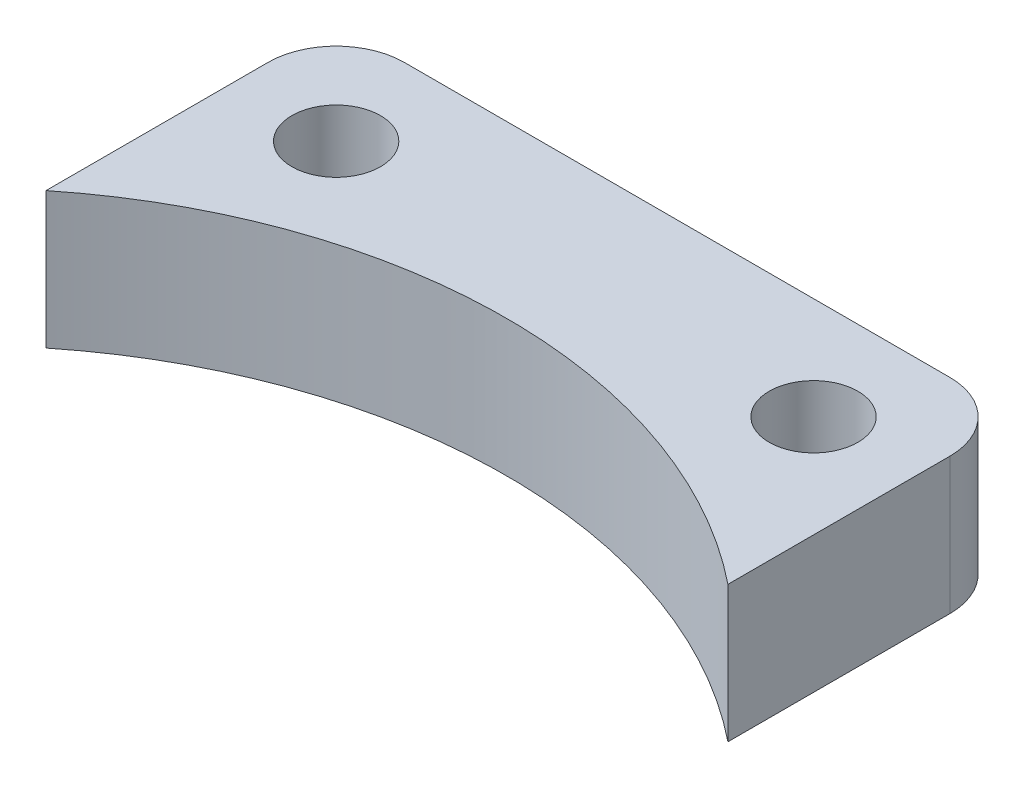
ISO-10303-21;
HEADER;
FILE_DESCRIPTION(('STEP AP214'),'2;1');
FILE_NAME('part.step','',(''),(''),'','','');
FILE_SCHEMA(('AUTOMOTIVE_DESIGN { 1 0 10303 214 1 1 1 1 }'));
ENDSEC;
DATA;
#1=APPLICATION_CONTEXT('core data for automotive mechanical design processes');
#2=APPLICATION_PROTOCOL_DEFINITION('international standard','automotive_design',2000,#1);
#3=PRODUCT_CONTEXT('',#1,'mechanical');
#4=PRODUCT('Part','Part','',(#3));
#5=PRODUCT_RELATED_PRODUCT_CATEGORY('part','',(#4));
#6=PRODUCT_DEFINITION_FORMATION('','',#4);
#7=PRODUCT_DEFINITION_CONTEXT('part definition',#1,'design');
#8=PRODUCT_DEFINITION('design','',#6,#7);
#9=PRODUCT_DEFINITION_SHAPE('','',#8);
#10=(LENGTH_UNIT() NAMED_UNIT(*) SI_UNIT(.MILLI.,.METRE.));
#11=(NAMED_UNIT(*) PLANE_ANGLE_UNIT() SI_UNIT($,.RADIAN.));
#12=(NAMED_UNIT(*) SI_UNIT($,.STERADIAN.) SOLID_ANGLE_UNIT());
#13=UNCERTAINTY_MEASURE_WITH_UNIT(LENGTH_MEASURE(1.E-05),#10,'distance_accuracy_value','');
#14=(GEOMETRIC_REPRESENTATION_CONTEXT(3) GLOBAL_UNCERTAINTY_ASSIGNED_CONTEXT((#13)) GLOBAL_UNIT_ASSIGNED_CONTEXT((#10,
#11,#12)) REPRESENTATION_CONTEXT('',''));
#15=CARTESIAN_POINT('',(0.,0.,0.));
#16=DIRECTION('',(0.,0.,1.));
#17=DIRECTION('',(1.,0.,0.));
#18=AXIS2_PLACEMENT_3D('',#15,#16,#17);
#19=CARTESIAN_POINT('',(0.,10.,0.));
#20=DIRECTION('',(0.,-1.,0.));
#21=DIRECTION('',(0.,0.,-1.));
#22=AXIS2_PLACEMENT_3D('',#19,#20,#21);
#23=CYLINDRICAL_SURFACE('',#22,40.);
#24=CARTESIAN_POINT('',(0.,0.,0.));
#25=DIRECTION('',(0.,-1.,0.));
#26=DIRECTION('',(0.,0.,1.));
#27=AXIS2_PLACEMENT_3D('',#24,#25,#26);
#28=CIRCLE('',#27,40.);
#29=CARTESIAN_POINT('',(-25.,0.,-31.224989991992));
#30=VERTEX_POINT('',#29);
#31=CARTESIAN_POINT('',(25.,0.,-31.224989991992));
#32=VERTEX_POINT('',#31);
#33=EDGE_CURVE('E104',#30,#32,#28,.T.);
#34=ORIENTED_EDGE('',*,*,#33,.T.);
#35=DIRECTION('',(0.,-1.,0.));
#36=VECTOR('',#35,1.);
#37=CARTESIAN_POINT('',(25.,10.,-31.224989991992));
#38=LINE('',#37,#36);
#39=CARTESIAN_POINT('',(25.,10.,-31.224989991992));
#40=VERTEX_POINT('',#39);
#41=EDGE_CURVE('E89',#40,#32,#38,.T.);
#42=ORIENTED_EDGE('',*,*,#41,.F.);
#43=CARTESIAN_POINT('',(0.,10.,0.));
#44=DIRECTION('',(0.,-1.,0.));
#45=DIRECTION('',(0.,0.,1.));
#46=AXIS2_PLACEMENT_3D('',#43,#44,#45);
#47=CIRCLE('',#46,40.);
#48=CARTESIAN_POINT('',(-25.,10.,-31.224989991992));
#49=VERTEX_POINT('',#48);
#50=EDGE_CURVE('E93',#49,#40,#47,.T.);
#51=ORIENTED_EDGE('',*,*,#50,.F.);
#52=DIRECTION('',(0.,-1.,0.));
#53=VECTOR('',#52,1.);
#54=CARTESIAN_POINT('',(-25.,10.,-31.224989991992));
#55=LINE('',#54,#53);
#56=EDGE_CURVE('E106',#49,#30,#55,.T.);
#57=ORIENTED_EDGE('',*,*,#56,.T.);
#58=EDGE_LOOP('',(#34,#42,#51,#57));
#59=FACE_BOUND('',#58,.T.);
#60=ADVANCED_FACE('F32',(#59),#23,.F.);
#61=CARTESIAN_POINT('',(25.,10.,-31.224989991992));
#62=DIRECTION('',(-1.,0.,0.));
#63=DIRECTION('',(0.,0.,1.));
#64=AXIS2_PLACEMENT_3D('',#61,#62,#63);
#65=PLANE('',#64);
#66=DIRECTION('',(0.,0.,-1.));
#67=VECTOR('',#66,1.);
#68=CARTESIAN_POINT('',(25.,0.,-31.224989991992));
#69=LINE('',#68,#67);
#70=CARTESIAN_POINT('',(25.,0.,-47.5));
#71=VERTEX_POINT('',#70);
#72=EDGE_CURVE('E132',#32,#71,#69,.T.);
#73=ORIENTED_EDGE('',*,*,#72,.T.);
#74=DIRECTION('',(0.,-1.,0.));
#75=VECTOR('',#74,1.);
#76=CARTESIAN_POINT('',(25.,10.,-47.5));
#77=LINE('',#76,#75);
#78=CARTESIAN_POINT('',(25.,10.,-47.5));
#79=VERTEX_POINT('',#78);
#80=EDGE_CURVE('E55',#71,#79,#77,.F.);
#81=ORIENTED_EDGE('',*,*,#80,.T.);
#82=DIRECTION('',(0.,0.,-1.));
#83=VECTOR('',#82,1.);
#84=CARTESIAN_POINT('',(25.,10.,-31.224989991992));
#85=LINE('',#84,#83);
#86=EDGE_CURVE('E85',#40,#79,#85,.T.);
#87=ORIENTED_EDGE('',*,*,#86,.F.);
#88=ORIENTED_EDGE('',*,*,#41,.T.);
#89=EDGE_LOOP('',(#73,#81,#87,#88));
#90=FACE_BOUND('',#89,.T.);
#91=ADVANCED_FACE('F87',(#90),#65,.F.);
#92=CARTESIAN_POINT('',(-25.,10.,-52.5));
#93=DIRECTION('',(0.,0.,1.));
#94=DIRECTION('',(1.,0.,0.));
#95=AXIS2_PLACEMENT_3D('',#92,#93,#94);
#96=PLANE('',#95);
#97=DIRECTION('',(-1.,0.,0.));
#98=VECTOR('',#97,1.);
#99=CARTESIAN_POINT('',(-25.,10.,-52.5));
#100=LINE('',#99,#98);
#101=CARTESIAN_POINT('',(20.,10.,-52.5));
#102=VERTEX_POINT('',#101);
#103=CARTESIAN_POINT('',(-20.,10.,-52.5));
#104=VERTEX_POINT('',#103);
#105=EDGE_CURVE('E92',#102,#104,#100,.T.);
#106=ORIENTED_EDGE('',*,*,#105,.F.);
#107=DIRECTION('',(0.,-1.,0.));
#108=VECTOR('',#107,1.);
#109=CARTESIAN_POINT('',(20.,10.,-52.5));
#110=LINE('',#109,#108);
#111=CARTESIAN_POINT('',(20.,0.,-52.5));
#112=VERTEX_POINT('',#111);
#113=EDGE_CURVE('E108',#102,#112,#110,.T.);
#114=ORIENTED_EDGE('',*,*,#113,.T.);
#115=DIRECTION('',(-1.,0.,0.));
#116=VECTOR('',#115,1.);
#117=CARTESIAN_POINT('',(-25.,0.,-52.5));
#118=LINE('',#117,#116);
#119=CARTESIAN_POINT('',(-20.,0.,-52.5));
#120=VERTEX_POINT('',#119);
#121=EDGE_CURVE('E133',#112,#120,#118,.T.);
#122=ORIENTED_EDGE('',*,*,#121,.T.);
#123=DIRECTION('',(0.,-1.,0.));
#124=VECTOR('',#123,1.);
#125=CARTESIAN_POINT('',(-20.,10.,-52.5));
#126=LINE('',#125,#124);
#127=EDGE_CURVE('E105',#120,#104,#126,.F.);
#128=ORIENTED_EDGE('',*,*,#127,.T.);
#129=EDGE_LOOP('',(#106,#114,#122,#128));
#130=FACE_BOUND('',#129,.T.);
#131=ADVANCED_FACE('F124',(#130),#96,.F.);
#132=CARTESIAN_POINT('',(-25.,10.,-31.224989991992));
#133=DIRECTION('',(1.,0.,0.));
#134=DIRECTION('',(0.,0.,-1.));
#135=AXIS2_PLACEMENT_3D('',#132,#133,#134);
#136=PLANE('',#135);
#137=DIRECTION('',(0.,0.,1.));
#138=VECTOR('',#137,1.);
#139=CARTESIAN_POINT('',(-25.,10.,-31.224989991992));
#140=LINE('',#139,#138);
#141=CARTESIAN_POINT('',(-25.,10.,-47.5));
#142=VERTEX_POINT('',#141);
#143=EDGE_CURVE('E97',#142,#49,#140,.T.);
#144=ORIENTED_EDGE('',*,*,#143,.F.);
#145=DIRECTION('',(0.,-1.,0.));
#146=VECTOR('',#145,1.);
#147=CARTESIAN_POINT('',(-25.,10.,-47.5));
#148=LINE('',#147,#146);
#149=CARTESIAN_POINT('',(-25.,0.,-47.5));
#150=VERTEX_POINT('',#149);
#151=EDGE_CURVE('E11',#142,#150,#148,.T.);
#152=ORIENTED_EDGE('',*,*,#151,.T.);
#153=DIRECTION('',(0.,0.,1.));
#154=VECTOR('',#153,1.);
#155=CARTESIAN_POINT('',(-25.,0.,-31.224989991992));
#156=LINE('',#155,#154);
#157=EDGE_CURVE('E101',#150,#30,#156,.T.);
#158=ORIENTED_EDGE('',*,*,#157,.T.);
#159=ORIENTED_EDGE('',*,*,#56,.F.);
#160=EDGE_LOOP('',(#144,#152,#158,#159));
#161=FACE_BOUND('',#160,.T.);
#162=ADVANCED_FACE('F141',(#161),#136,.F.);
#163=CARTESIAN_POINT('',(0.,10.,0.));
#164=DIRECTION('',(0.,1.,0.));
#165=DIRECTION('',(0.,0.,1.));
#166=AXIS2_PLACEMENT_3D('',#163,#164,#165);
#167=PLANE('',#166);
#168=CARTESIAN_POINT('',(17.5,10.,-45.));
#169=DIRECTION('',(0.,1.,0.));
#170=DIRECTION('',(0.,0.,1.));
#171=AXIS2_PLACEMENT_3D('',#168,#169,#170);
#172=CIRCLE('',#171,3.25);
#173=CARTESIAN_POINT('',(17.5,10.,-41.75));
#174=VERTEX_POINT('',#173);
#175=EDGE_CURVE('E180',#174,#174,#172,.T.);
#176=ORIENTED_EDGE('',*,*,#175,.F.);
#177=EDGE_LOOP('',(#176));
#178=FACE_BOUND('',#177,.T.);
#179=CARTESIAN_POINT('',(-17.5,10.,-45.));
#180=DIRECTION('',(0.,1.,0.));
#181=DIRECTION('',(0.,0.,1.));
#182=AXIS2_PLACEMENT_3D('',#179,#180,#181);
#183=CIRCLE('',#182,3.25);
#184=CARTESIAN_POINT('',(-17.5,10.,-41.75));
#185=VERTEX_POINT('',#184);
#186=EDGE_CURVE('E182',#185,#185,#183,.T.);
#187=ORIENTED_EDGE('',*,*,#186,.F.);
#188=EDGE_LOOP('',(#187));
#189=FACE_BOUND('',#188,.T.);
#190=ORIENTED_EDGE('',*,*,#86,.T.);
#191=CARTESIAN_POINT('',(20.,10.,-47.5));
#192=DIRECTION('',(0.,1.,0.));
#193=DIRECTION('',(0.,0.,1.));
#194=AXIS2_PLACEMENT_3D('',#191,#192,#193);
#195=CIRCLE('',#194,5.);
#196=EDGE_CURVE('E40',#79,#102,#195,.T.);
#197=ORIENTED_EDGE('',*,*,#196,.T.);
#198=ORIENTED_EDGE('',*,*,#105,.T.);
#199=CARTESIAN_POINT('',(-20.,10.,-47.5));
#200=DIRECTION('',(0.,1.,0.));
#201=DIRECTION('',(0.,0.,1.));
#202=AXIS2_PLACEMENT_3D('',#199,#200,#201);
#203=CIRCLE('',#202,5.);
#204=EDGE_CURVE('E47',#104,#142,#203,.T.);
#205=ORIENTED_EDGE('',*,*,#204,.T.);
#206=ORIENTED_EDGE('',*,*,#143,.T.);
#207=ORIENTED_EDGE('',*,*,#50,.T.);
#208=EDGE_LOOP('',(#190,#197,#198,#205,#206,#207));
#209=FACE_BOUND('',#208,.T.);
#210=ADVANCED_FACE('F96',(#178,#189,#209),#167,.T.);
#211=CARTESIAN_POINT('',(0.,0.,0.));
#212=DIRECTION('',(0.,1.,0.));
#213=DIRECTION('',(0.,0.,1.));
#214=AXIS2_PLACEMENT_3D('',#211,#212,#213);
#215=PLANE('',#214);
#216=CARTESIAN_POINT('',(17.5,0.,-45.));
#217=DIRECTION('',(0.,1.,0.));
#218=DIRECTION('',(0.,0.,1.));
#219=AXIS2_PLACEMENT_3D('',#216,#217,#218);
#220=CIRCLE('',#219,3.25);
#221=CARTESIAN_POINT('',(17.5,0.,-41.75));
#222=VERTEX_POINT('',#221);
#223=EDGE_CURVE('E177',#222,#222,#220,.T.);
#224=ORIENTED_EDGE('',*,*,#223,.T.);
#225=EDGE_LOOP('',(#224));
#226=FACE_BOUND('',#225,.T.);
#227=CARTESIAN_POINT('',(-17.5,0.,-45.));
#228=DIRECTION('',(0.,1.,0.));
#229=DIRECTION('',(0.,0.,1.));
#230=AXIS2_PLACEMENT_3D('',#227,#228,#229);
#231=CIRCLE('',#230,3.25);
#232=CARTESIAN_POINT('',(-17.5,0.,-41.75));
#233=VERTEX_POINT('',#232);
#234=EDGE_CURVE('E136',#233,#233,#231,.T.);
#235=ORIENTED_EDGE('',*,*,#234,.T.);
#236=EDGE_LOOP('',(#235));
#237=FACE_BOUND('',#236,.T.);
#238=ORIENTED_EDGE('',*,*,#121,.F.);
#239=CARTESIAN_POINT('',(20.,0.,-47.5));
#240=DIRECTION('',(0.,1.,0.));
#241=DIRECTION('',(0.,0.,1.));
#242=AXIS2_PLACEMENT_3D('',#239,#240,#241);
#243=CIRCLE('',#242,5.);
#244=EDGE_CURVE('E117',#112,#71,#243,.F.);
#245=ORIENTED_EDGE('',*,*,#244,.T.);
#246=ORIENTED_EDGE('',*,*,#72,.F.);
#247=ORIENTED_EDGE('',*,*,#33,.F.);
#248=ORIENTED_EDGE('',*,*,#157,.F.);
#249=CARTESIAN_POINT('',(-20.,0.,-47.5));
#250=DIRECTION('',(0.,1.,0.));
#251=DIRECTION('',(0.,0.,1.));
#252=AXIS2_PLACEMENT_3D('',#249,#250,#251);
#253=CIRCLE('',#252,5.);
#254=EDGE_CURVE('E115',#150,#120,#253,.F.);
#255=ORIENTED_EDGE('',*,*,#254,.T.);
#256=EDGE_LOOP('',(#238,#245,#246,#247,#248,#255));
#257=FACE_BOUND('',#256,.T.);
#258=ADVANCED_FACE('F131',(#226,#237,#257),#215,.F.);
#259=CARTESIAN_POINT('',(20.,10.,-47.5));
#260=DIRECTION('',(0.,-1.,0.));
#261=DIRECTION('',(0.,0.,-1.));
#262=AXIS2_PLACEMENT_3D('',#259,#260,#261);
#263=CYLINDRICAL_SURFACE('',#262,5.);
#264=ORIENTED_EDGE('',*,*,#196,.F.);
#265=ORIENTED_EDGE('',*,*,#80,.F.);
#266=ORIENTED_EDGE('',*,*,#244,.F.);
#267=ORIENTED_EDGE('',*,*,#113,.F.);
#268=EDGE_LOOP('',(#264,#265,#266,#267));
#269=FACE_BOUND('',#268,.T.);
#270=ADVANCED_FACE('F129',(#269),#263,.T.);
#271=CARTESIAN_POINT('',(-20.,10.,-47.5));
#272=DIRECTION('',(0.,-1.,0.));
#273=DIRECTION('',(0.,0.,-1.));
#274=AXIS2_PLACEMENT_3D('',#271,#272,#273);
#275=CYLINDRICAL_SURFACE('',#274,5.);
#276=ORIENTED_EDGE('',*,*,#204,.F.);
#277=ORIENTED_EDGE('',*,*,#127,.F.);
#278=ORIENTED_EDGE('',*,*,#254,.F.);
#279=ORIENTED_EDGE('',*,*,#151,.F.);
#280=EDGE_LOOP('',(#276,#277,#278,#279));
#281=FACE_BOUND('',#280,.T.);
#282=ADVANCED_FACE('F34',(#281),#275,.T.);
#283=CARTESIAN_POINT('',(-17.5,0.,-45.));
#284=DIRECTION('',(0.,1.,0.));
#285=DIRECTION('',(0.,0.,1.));
#286=AXIS2_PLACEMENT_3D('',#283,#284,#285);
#287=CYLINDRICAL_SURFACE('',#286,3.25);
#288=ORIENTED_EDGE('',*,*,#234,.F.);
#289=EDGE_LOOP('',(#288));
#290=FACE_BOUND('',#289,.T.);
#291=ORIENTED_EDGE('',*,*,#186,.T.);
#292=EDGE_LOOP('',(#291));
#293=FACE_BOUND('',#292,.T.);
#294=ADVANCED_FACE('F145',(#290,#293),#287,.F.);
#295=CARTESIAN_POINT('',(17.5,0.,-45.));
#296=DIRECTION('',(0.,1.,0.));
#297=DIRECTION('',(0.,0.,1.));
#298=AXIS2_PLACEMENT_3D('',#295,#296,#297);
#299=CYLINDRICAL_SURFACE('',#298,3.25);
#300=ORIENTED_EDGE('',*,*,#223,.F.);
#301=EDGE_LOOP('',(#300));
#302=FACE_BOUND('',#301,.T.);
#303=ORIENTED_EDGE('',*,*,#175,.T.);
#304=EDGE_LOOP('',(#303));
#305=FACE_BOUND('',#304,.T.);
#306=ADVANCED_FACE('F150',(#302,#305),#299,.F.);
#307=CLOSED_SHELL('',(#60,#91,#131,#162,#210,#258,#270,#282,#294,#306));
#308=MANIFOLD_SOLID_BREP('B2',#307);
#309=ADVANCED_BREP_SHAPE_REPRESENTATION('',(#18,#308),#14);
#310=SHAPE_DEFINITION_REPRESENTATION(#9,#309);
ENDSEC;
END-ISO-10303-21;
